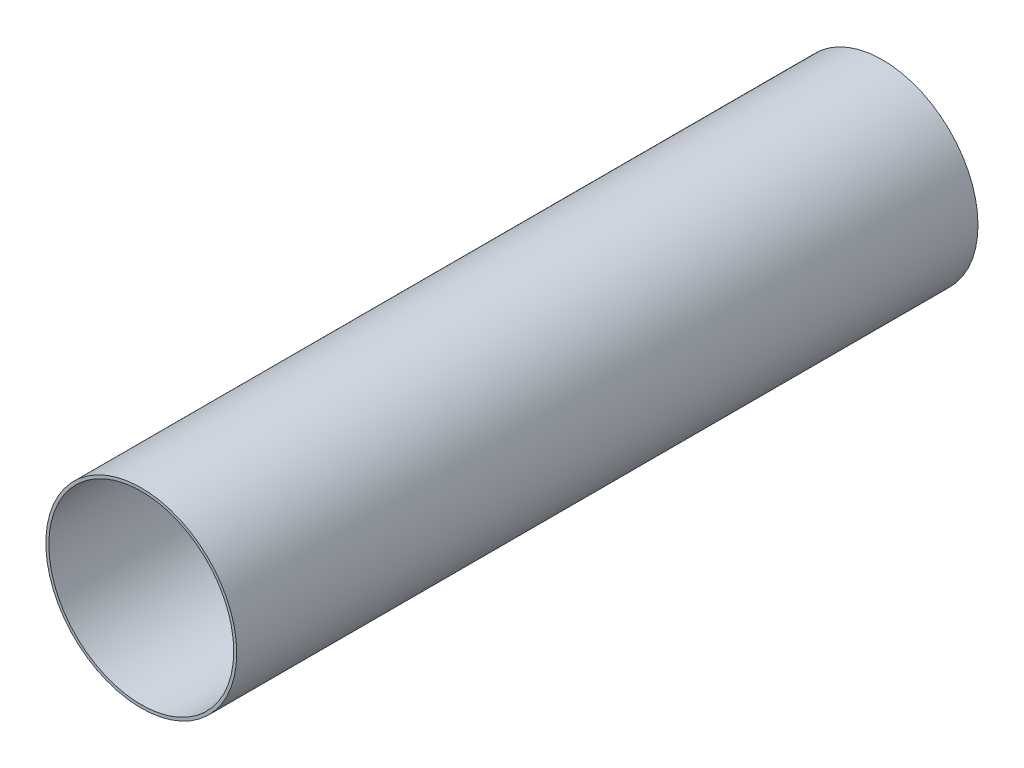
ISO-10303-21;
HEADER;
FILE_DESCRIPTION(('STEP AP214'),'2;1');
FILE_NAME('part.step','',(''),(''),'','','');
FILE_SCHEMA(('AUTOMOTIVE_DESIGN { 1 0 10303 214 1 1 1 1 }'));
ENDSEC;
DATA;
#1=APPLICATION_CONTEXT('core data for automotive mechanical design processes');
#2=APPLICATION_PROTOCOL_DEFINITION('international standard','automotive_design',2000,#1);
#3=PRODUCT_CONTEXT('',#1,'mechanical');
#4=PRODUCT('Part','Part','',(#3));
#5=PRODUCT_RELATED_PRODUCT_CATEGORY('part','',(#4));
#6=PRODUCT_DEFINITION_FORMATION('','',#4);
#7=PRODUCT_DEFINITION_CONTEXT('part definition',#1,'design');
#8=PRODUCT_DEFINITION('design','',#6,#7);
#9=PRODUCT_DEFINITION_SHAPE('','',#8);
#10=(LENGTH_UNIT() NAMED_UNIT(*) SI_UNIT(.MILLI.,.METRE.));
#11=(NAMED_UNIT(*) PLANE_ANGLE_UNIT() SI_UNIT($,.RADIAN.));
#12=(NAMED_UNIT(*) SI_UNIT($,.STERADIAN.) SOLID_ANGLE_UNIT());
#13=UNCERTAINTY_MEASURE_WITH_UNIT(LENGTH_MEASURE(1.E-05),#10,'distance_accuracy_value','');
#14=(GEOMETRIC_REPRESENTATION_CONTEXT(3) GLOBAL_UNCERTAINTY_ASSIGNED_CONTEXT((#13)) GLOBAL_UNIT_ASSIGNED_CONTEXT((#10,
#11,#12)) REPRESENTATION_CONTEXT('',''));
#15=CARTESIAN_POINT('',(0.,0.,0.));
#16=DIRECTION('',(0.,0.,1.));
#17=DIRECTION('',(1.,0.,0.));
#18=AXIS2_PLACEMENT_3D('',#15,#16,#17);
#19=CARTESIAN_POINT('',(0.,0.,254.));
#20=DIRECTION('',(0.,0.,1.));
#21=DIRECTION('',(1.,0.,0.));
#22=AXIS2_PLACEMENT_3D('',#19,#20,#21);
#23=PLANE('',#22);
#24=CARTESIAN_POINT('',(0.,0.,254.));
#25=DIRECTION('',(0.,0.,1.));
#26=DIRECTION('',(1.,0.,0.));
#27=AXIS2_PLACEMENT_3D('',#24,#25,#26);
#28=CIRCLE('',#27,65.405);
#29=CARTESIAN_POINT('',(65.405,0.,254.));
#30=VERTEX_POINT('',#29);
#31=EDGE_CURVE('E10',#30,#30,#28,.T.);
#32=ORIENTED_EDGE('',*,*,#31,.T.);
#33=EDGE_LOOP('',(#32));
#34=FACE_BOUND('',#33,.T.);
#35=CARTESIAN_POINT('',(0.,0.,254.));
#36=DIRECTION('',(0.,0.,1.));
#37=DIRECTION('',(1.,0.,0.));
#38=AXIS2_PLACEMENT_3D('',#35,#36,#37);
#39=CIRCLE('',#38,63.373);
#40=CARTESIAN_POINT('',(63.373,0.,254.));
#41=VERTEX_POINT('',#40);
#42=EDGE_CURVE('E60',#41,#41,#39,.T.);
#43=ORIENTED_EDGE('',*,*,#42,.F.);
#44=EDGE_LOOP('',(#43));
#45=FACE_BOUND('',#44,.T.);
#46=ADVANCED_FACE('F49',(#34,#45),#23,.T.);
#47=CARTESIAN_POINT('',(0.,0.,-254.));
#48=DIRECTION('',(0.,0.,1.));
#49=DIRECTION('',(1.,0.,0.));
#50=AXIS2_PLACEMENT_3D('',#47,#48,#49);
#51=PLANE('',#50);
#52=CARTESIAN_POINT('',(0.,0.,-254.));
#53=DIRECTION('',(0.,0.,1.));
#54=DIRECTION('',(1.,0.,0.));
#55=AXIS2_PLACEMENT_3D('',#52,#53,#54);
#56=CIRCLE('',#55,65.405);
#57=CARTESIAN_POINT('',(65.405,0.,-254.));
#58=VERTEX_POINT('',#57);
#59=EDGE_CURVE('E53',#58,#58,#56,.T.);
#60=ORIENTED_EDGE('',*,*,#59,.F.);
#61=EDGE_LOOP('',(#60));
#62=FACE_BOUND('',#61,.T.);
#63=CARTESIAN_POINT('',(0.,0.,-254.));
#64=DIRECTION('',(0.,0.,1.));
#65=DIRECTION('',(1.,0.,0.));
#66=AXIS2_PLACEMENT_3D('',#63,#64,#65);
#67=CIRCLE('',#66,63.373);
#68=CARTESIAN_POINT('',(63.373,0.,-254.));
#69=VERTEX_POINT('',#68);
#70=EDGE_CURVE('E62',#69,#69,#67,.T.);
#71=ORIENTED_EDGE('',*,*,#70,.T.);
#72=EDGE_LOOP('',(#71));
#73=FACE_BOUND('',#72,.T.);
#74=ADVANCED_FACE('F72',(#62,#73),#51,.F.);
#75=CARTESIAN_POINT('',(0.,0.,254.));
#76=DIRECTION('',(0.,0.,-1.));
#77=DIRECTION('',(-1.,0.,0.));
#78=AXIS2_PLACEMENT_3D('',#75,#76,#77);
#79=CYLINDRICAL_SURFACE('',#78,65.405);
#80=ORIENTED_EDGE('',*,*,#31,.F.);
#81=EDGE_LOOP('',(#80));
#82=FACE_BOUND('',#81,.T.);
#83=ORIENTED_EDGE('',*,*,#59,.T.);
#84=EDGE_LOOP('',(#83));
#85=FACE_BOUND('',#84,.T.);
#86=ADVANCED_FACE('F51',(#82,#85),#79,.T.);
#87=CARTESIAN_POINT('',(0.,0.,254.));
#88=DIRECTION('',(0.,0.,-1.));
#89=DIRECTION('',(-1.,0.,0.));
#90=AXIS2_PLACEMENT_3D('',#87,#88,#89);
#91=CYLINDRICAL_SURFACE('',#90,63.373);
#92=ORIENTED_EDGE('',*,*,#42,.T.);
#93=EDGE_LOOP('',(#92));
#94=FACE_BOUND('',#93,.T.);
#95=ORIENTED_EDGE('',*,*,#70,.F.);
#96=EDGE_LOOP('',(#95));
#97=FACE_BOUND('',#96,.T.);
#98=ADVANCED_FACE('F68',(#94,#97),#91,.F.);
#99=CLOSED_SHELL('',(#46,#74,#86,#98));
#100=MANIFOLD_SOLID_BREP('B2',#99);
#101=ADVANCED_BREP_SHAPE_REPRESENTATION('',(#18,#100),#14);
#102=SHAPE_DEFINITION_REPRESENTATION(#9,#101);
ENDSEC;
END-ISO-10303-21;
